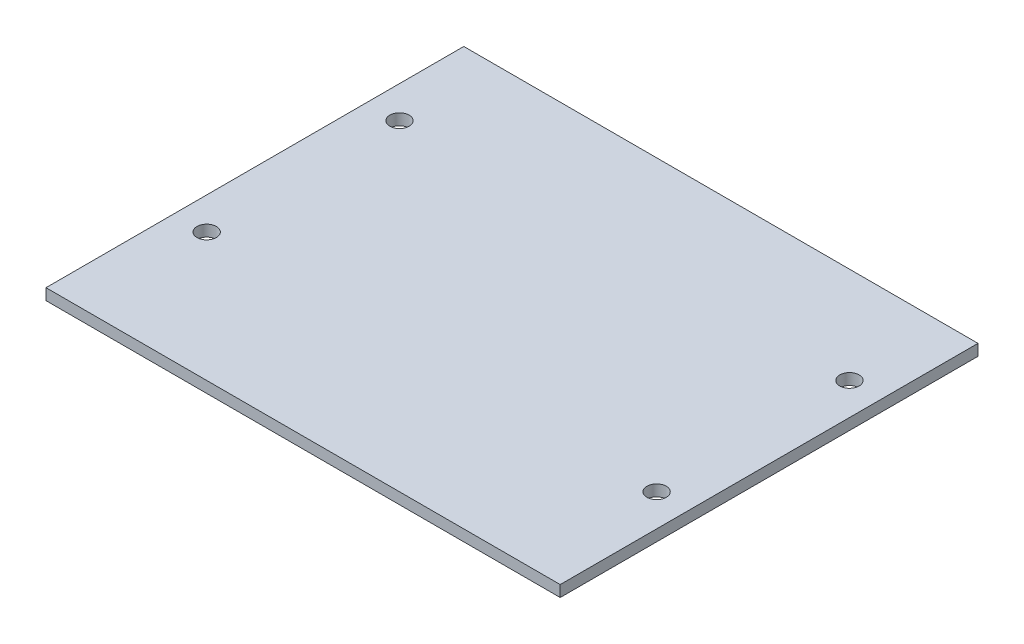
ISO-10303-21;
HEADER;
FILE_DESCRIPTION(('STEP AP214'),'2;1');
FILE_NAME('part.step','',(''),(''),'','','');
FILE_SCHEMA(('AUTOMOTIVE_DESIGN { 1 0 10303 214 1 1 1 1 }'));
ENDSEC;
DATA;
#1=APPLICATION_CONTEXT('core data for automotive mechanical design processes');
#2=APPLICATION_PROTOCOL_DEFINITION('international standard','automotive_design',2000,#1);
#3=PRODUCT_CONTEXT('',#1,'mechanical');
#4=PRODUCT('Part','Part','',(#3));
#5=PRODUCT_RELATED_PRODUCT_CATEGORY('part','',(#4));
#6=PRODUCT_DEFINITION_FORMATION('','',#4);
#7=PRODUCT_DEFINITION_CONTEXT('part definition',#1,'design');
#8=PRODUCT_DEFINITION('design','',#6,#7);
#9=PRODUCT_DEFINITION_SHAPE('','',#8);
#10=(LENGTH_UNIT() NAMED_UNIT(*) SI_UNIT(.MILLI.,.METRE.));
#11=(NAMED_UNIT(*) PLANE_ANGLE_UNIT() SI_UNIT($,.RADIAN.));
#12=(NAMED_UNIT(*) SI_UNIT($,.STERADIAN.) SOLID_ANGLE_UNIT());
#13=UNCERTAINTY_MEASURE_WITH_UNIT(LENGTH_MEASURE(1.E-05),#10,'distance_accuracy_value','');
#14=(GEOMETRIC_REPRESENTATION_CONTEXT(3) GLOBAL_UNCERTAINTY_ASSIGNED_CONTEXT((#13)) GLOBAL_UNIT_ASSIGNED_CONTEXT((#10,
#11,#12)) REPRESENTATION_CONTEXT('',''));
#15=CARTESIAN_POINT('',(0.,0.,0.));
#16=DIRECTION('',(0.,0.,1.));
#17=DIRECTION('',(1.,0.,0.));
#18=AXIS2_PLACEMENT_3D('',#15,#16,#17);
#19=CARTESIAN_POINT('',(0.,1.75,0.));
#20=DIRECTION('',(0.,1.,0.));
#21=DIRECTION('',(0.,0.,1.));
#22=AXIS2_PLACEMENT_3D('',#19,#20,#21);
#23=PLANE('',#22);
#24=CARTESIAN_POINT('',(35.,1.75,-17.5));
#25=DIRECTION('',(0.,1.,0.));
#26=DIRECTION('',(0.,0.,1.));
#27=AXIS2_PLACEMENT_3D('',#24,#25,#26);
#28=CIRCLE('',#27,1.5025);
#29=CARTESIAN_POINT('',(35.,1.75,-15.9975));
#30=VERTEX_POINT('',#29);
#31=EDGE_CURVE('E120',#30,#30,#28,.T.);
#32=ORIENTED_EDGE('',*,*,#31,.F.);
#33=EDGE_LOOP('',(#32));
#34=FACE_BOUND('',#33,.T.);
#35=CARTESIAN_POINT('',(-35.,1.75,12.5));
#36=DIRECTION('',(0.,1.,0.));
#37=DIRECTION('',(0.,0.,1.));
#38=AXIS2_PLACEMENT_3D('',#35,#36,#37);
#39=CIRCLE('',#38,1.5025);
#40=CARTESIAN_POINT('',(-35.,1.75,14.0025));
#41=VERTEX_POINT('',#40);
#42=EDGE_CURVE('E99',#41,#41,#39,.T.);
#43=ORIENTED_EDGE('',*,*,#42,.F.);
#44=EDGE_LOOP('',(#43));
#45=FACE_BOUND('',#44,.T.);
#46=DIRECTION('',(0.,0.,1.));
#47=VECTOR('',#46,1.);
#48=CARTESIAN_POINT('',(-40.,1.75,-32.5));
#49=LINE('',#48,#47);
#50=CARTESIAN_POINT('',(-40.,1.75,-32.5));
#51=VERTEX_POINT('',#50);
#52=CARTESIAN_POINT('',(-40.,1.75,32.5));
#53=VERTEX_POINT('',#52);
#54=EDGE_CURVE('E84',#51,#53,#49,.T.);
#55=ORIENTED_EDGE('',*,*,#54,.T.);
#56=DIRECTION('',(1.,0.,0.));
#57=VECTOR('',#56,1.);
#58=CARTESIAN_POINT('',(-40.,1.75,32.5));
#59=LINE('',#58,#57);
#60=CARTESIAN_POINT('',(40.,1.75,32.5));
#61=VERTEX_POINT('',#60);
#62=EDGE_CURVE('E79',#53,#61,#59,.T.);
#63=ORIENTED_EDGE('',*,*,#62,.T.);
#64=DIRECTION('',(0.,0.,-1.));
#65=VECTOR('',#64,1.);
#66=CARTESIAN_POINT('',(40.,1.75,-32.5));
#67=LINE('',#66,#65);
#68=CARTESIAN_POINT('',(40.,1.75,-32.5));
#69=VERTEX_POINT('',#68);
#70=EDGE_CURVE('E82',#61,#69,#67,.T.);
#71=ORIENTED_EDGE('',*,*,#70,.T.);
#72=DIRECTION('',(-1.,0.,0.));
#73=VECTOR('',#72,1.);
#74=CARTESIAN_POINT('',(-40.,1.75,-32.5));
#75=LINE('',#74,#73);
#76=EDGE_CURVE('E49',#69,#51,#75,.T.);
#77=ORIENTED_EDGE('',*,*,#76,.T.);
#78=EDGE_LOOP('',(#55,#63,#71,#77));
#79=FACE_BOUND('',#78,.T.);
#80=CARTESIAN_POINT('',(35.,1.75,12.5));
#81=DIRECTION('',(0.,1.,0.));
#82=DIRECTION('',(0.,0.,1.));
#83=AXIS2_PLACEMENT_3D('',#80,#81,#82);
#84=CIRCLE('',#83,1.5025);
#85=CARTESIAN_POINT('',(35.,1.75,14.0025));
#86=VERTEX_POINT('',#85);
#87=EDGE_CURVE('E114',#86,#86,#84,.T.);
#88=ORIENTED_EDGE('',*,*,#87,.F.);
#89=EDGE_LOOP('',(#88));
#90=FACE_BOUND('',#89,.T.);
#91=CARTESIAN_POINT('',(-35.,1.75,-17.5));
#92=DIRECTION('',(0.,1.,0.));
#93=DIRECTION('',(0.,0.,1.));
#94=AXIS2_PLACEMENT_3D('',#91,#92,#93);
#95=CIRCLE('',#94,1.5025);
#96=CARTESIAN_POINT('',(-35.,1.75,-15.9975));
#97=VERTEX_POINT('',#96);
#98=EDGE_CURVE('E126',#97,#97,#95,.T.);
#99=ORIENTED_EDGE('',*,*,#98,.F.);
#100=EDGE_LOOP('',(#99));
#101=FACE_BOUND('',#100,.T.);
#102=ADVANCED_FACE('F32',(#34,#45,#79,#90,#101),#23,.T.);
#103=CARTESIAN_POINT('',(0.,0.,0.));
#104=DIRECTION('',(0.,1.,0.));
#105=DIRECTION('',(0.,0.,1.));
#106=AXIS2_PLACEMENT_3D('',#103,#104,#105);
#107=PLANE('',#106);
#108=DIRECTION('',(0.,0.,1.));
#109=VECTOR('',#108,1.);
#110=CARTESIAN_POINT('',(-40.,0.,-32.5));
#111=LINE('',#110,#109);
#112=CARTESIAN_POINT('',(-40.,0.,-32.5));
#113=VERTEX_POINT('',#112);
#114=CARTESIAN_POINT('',(-40.,0.,32.5));
#115=VERTEX_POINT('',#114);
#116=EDGE_CURVE('E96',#113,#115,#111,.T.);
#117=ORIENTED_EDGE('',*,*,#116,.F.);
#118=DIRECTION('',(-1.,0.,0.));
#119=VECTOR('',#118,1.);
#120=CARTESIAN_POINT('',(-40.,0.,-32.5));
#121=LINE('',#120,#119);
#122=CARTESIAN_POINT('',(40.,0.,-32.5));
#123=VERTEX_POINT('',#122);
#124=EDGE_CURVE('E72',#123,#113,#121,.T.);
#125=ORIENTED_EDGE('',*,*,#124,.F.);
#126=DIRECTION('',(0.,0.,-1.));
#127=VECTOR('',#126,1.);
#128=CARTESIAN_POINT('',(40.,0.,-32.5));
#129=LINE('',#128,#127);
#130=CARTESIAN_POINT('',(40.,0.,32.5));
#131=VERTEX_POINT('',#130);
#132=EDGE_CURVE('E66',#131,#123,#129,.T.);
#133=ORIENTED_EDGE('',*,*,#132,.F.);
#134=DIRECTION('',(1.,0.,0.));
#135=VECTOR('',#134,1.);
#136=CARTESIAN_POINT('',(-40.,0.,32.5));
#137=LINE('',#136,#135);
#138=EDGE_CURVE('E88',#115,#131,#137,.T.);
#139=ORIENTED_EDGE('',*,*,#138,.F.);
#140=EDGE_LOOP('',(#117,#125,#133,#139));
#141=FACE_BOUND('',#140,.T.);
#142=CARTESIAN_POINT('',(-35.,0.,12.5));
#143=DIRECTION('',(0.,1.,0.));
#144=DIRECTION('',(0.,0.,1.));
#145=AXIS2_PLACEMENT_3D('',#142,#143,#144);
#146=CIRCLE('',#145,1.5025);
#147=CARTESIAN_POINT('',(-35.,0.,14.0025));
#148=VERTEX_POINT('',#147);
#149=EDGE_CURVE('E111',#148,#148,#146,.T.);
#150=ORIENTED_EDGE('',*,*,#149,.T.);
#151=EDGE_LOOP('',(#150));
#152=FACE_BOUND('',#151,.T.);
#153=CARTESIAN_POINT('',(35.,0.,12.5));
#154=DIRECTION('',(0.,1.,0.));
#155=DIRECTION('',(0.,0.,1.));
#156=AXIS2_PLACEMENT_3D('',#153,#154,#155);
#157=CIRCLE('',#156,1.5025);
#158=CARTESIAN_POINT('',(35.,0.,14.0025));
#159=VERTEX_POINT('',#158);
#160=EDGE_CURVE('E117',#159,#159,#157,.T.);
#161=ORIENTED_EDGE('',*,*,#160,.T.);
#162=EDGE_LOOP('',(#161));
#163=FACE_BOUND('',#162,.T.);
#164=CARTESIAN_POINT('',(35.,0.,-17.5));
#165=DIRECTION('',(0.,1.,0.));
#166=DIRECTION('',(0.,0.,1.));
#167=AXIS2_PLACEMENT_3D('',#164,#165,#166);
#168=CIRCLE('',#167,1.5025);
#169=CARTESIAN_POINT('',(35.,0.,-15.9975));
#170=VERTEX_POINT('',#169);
#171=EDGE_CURVE('E123',#170,#170,#168,.T.);
#172=ORIENTED_EDGE('',*,*,#171,.T.);
#173=EDGE_LOOP('',(#172));
#174=FACE_BOUND('',#173,.T.);
#175=CARTESIAN_POINT('',(-35.,0.,-17.5));
#176=DIRECTION('',(0.,1.,0.));
#177=DIRECTION('',(0.,0.,1.));
#178=AXIS2_PLACEMENT_3D('',#175,#176,#177);
#179=CIRCLE('',#178,1.5025);
#180=CARTESIAN_POINT('',(-35.,0.,-15.9975));
#181=VERTEX_POINT('',#180);
#182=EDGE_CURVE('E129',#181,#181,#179,.T.);
#183=ORIENTED_EDGE('',*,*,#182,.T.);
#184=EDGE_LOOP('',(#183));
#185=FACE_BOUND('',#184,.T.);
#186=ADVANCED_FACE('F107',(#141,#152,#163,#174,#185),#107,.F.);
#187=CARTESIAN_POINT('',(-40.,1.75,-32.5));
#188=DIRECTION('',(1.,0.,0.));
#189=DIRECTION('',(0.,0.,-1.));
#190=AXIS2_PLACEMENT_3D('',#187,#188,#189);
#191=PLANE('',#190);
#192=ORIENTED_EDGE('',*,*,#116,.T.);
#193=DIRECTION('',(0.,-1.,0.));
#194=VECTOR('',#193,1.);
#195=CARTESIAN_POINT('',(-40.,1.75,32.5));
#196=LINE('',#195,#194);
#197=EDGE_CURVE('E11',#53,#115,#196,.T.);
#198=ORIENTED_EDGE('',*,*,#197,.F.);
#199=ORIENTED_EDGE('',*,*,#54,.F.);
#200=DIRECTION('',(0.,-1.,0.));
#201=VECTOR('',#200,1.);
#202=CARTESIAN_POINT('',(-40.,1.75,-32.5));
#203=LINE('',#202,#201);
#204=EDGE_CURVE('E92',#51,#113,#203,.T.);
#205=ORIENTED_EDGE('',*,*,#204,.T.);
#206=EDGE_LOOP('',(#192,#198,#199,#205));
#207=FACE_BOUND('',#206,.T.);
#208=ADVANCED_FACE('F34',(#207),#191,.F.);
#209=CARTESIAN_POINT('',(-40.,1.75,32.5));
#210=DIRECTION('',(0.,0.,-1.));
#211=DIRECTION('',(-1.,0.,0.));
#212=AXIS2_PLACEMENT_3D('',#209,#210,#211);
#213=PLANE('',#212);
#214=ORIENTED_EDGE('',*,*,#138,.T.);
#215=DIRECTION('',(0.,-1.,0.));
#216=VECTOR('',#215,1.);
#217=CARTESIAN_POINT('',(40.,1.75,32.5));
#218=LINE('',#217,#216);
#219=EDGE_CURVE('E41',#61,#131,#218,.T.);
#220=ORIENTED_EDGE('',*,*,#219,.F.);
#221=ORIENTED_EDGE('',*,*,#62,.F.);
#222=ORIENTED_EDGE('',*,*,#197,.T.);
#223=EDGE_LOOP('',(#214,#220,#221,#222));
#224=FACE_BOUND('',#223,.T.);
#225=ADVANCED_FACE('F87',(#224),#213,.F.);
#226=CARTESIAN_POINT('',(40.,1.75,-32.5));
#227=DIRECTION('',(-1.,0.,0.));
#228=DIRECTION('',(0.,0.,1.));
#229=AXIS2_PLACEMENT_3D('',#226,#227,#228);
#230=PLANE('',#229);
#231=ORIENTED_EDGE('',*,*,#132,.T.);
#232=DIRECTION('',(0.,-1.,0.));
#233=VECTOR('',#232,1.);
#234=CARTESIAN_POINT('',(40.,1.75,-32.5));
#235=LINE('',#234,#233);
#236=EDGE_CURVE('E89',#69,#123,#235,.T.);
#237=ORIENTED_EDGE('',*,*,#236,.F.);
#238=ORIENTED_EDGE('',*,*,#70,.F.);
#239=ORIENTED_EDGE('',*,*,#219,.T.);
#240=EDGE_LOOP('',(#231,#237,#238,#239));
#241=FACE_BOUND('',#240,.T.);
#242=ADVANCED_FACE('F90',(#241),#230,.F.);
#243=CARTESIAN_POINT('',(-40.,1.75,-32.5));
#244=DIRECTION('',(0.,0.,1.));
#245=DIRECTION('',(1.,0.,0.));
#246=AXIS2_PLACEMENT_3D('',#243,#244,#245);
#247=PLANE('',#246);
#248=ORIENTED_EDGE('',*,*,#124,.T.);
#249=ORIENTED_EDGE('',*,*,#204,.F.);
#250=ORIENTED_EDGE('',*,*,#76,.F.);
#251=ORIENTED_EDGE('',*,*,#236,.T.);
#252=EDGE_LOOP('',(#248,#249,#250,#251));
#253=FACE_BOUND('',#252,.T.);
#254=ADVANCED_FACE('F104',(#253),#247,.F.);
#255=CARTESIAN_POINT('',(-35.,1.75,12.5));
#256=DIRECTION('',(0.,-1.,0.));
#257=DIRECTION('',(0.,0.,-1.));
#258=AXIS2_PLACEMENT_3D('',#255,#256,#257);
#259=CYLINDRICAL_SURFACE('',#258,1.5025);
#260=ORIENTED_EDGE('',*,*,#42,.T.);
#261=EDGE_LOOP('',(#260));
#262=FACE_BOUND('',#261,.T.);
#263=ORIENTED_EDGE('',*,*,#149,.F.);
#264=EDGE_LOOP('',(#263));
#265=FACE_BOUND('',#264,.T.);
#266=ADVANCED_FACE('F148',(#262,#265),#259,.F.);
#267=CARTESIAN_POINT('',(35.,1.75,12.5));
#268=DIRECTION('',(0.,-1.,0.));
#269=DIRECTION('',(0.,0.,-1.));
#270=AXIS2_PLACEMENT_3D('',#267,#268,#269);
#271=CYLINDRICAL_SURFACE('',#270,1.5025);
#272=ORIENTED_EDGE('',*,*,#87,.T.);
#273=EDGE_LOOP('',(#272));
#274=FACE_BOUND('',#273,.T.);
#275=ORIENTED_EDGE('',*,*,#160,.F.);
#276=EDGE_LOOP('',(#275));
#277=FACE_BOUND('',#276,.T.);
#278=ADVANCED_FACE('F194',(#274,#277),#271,.F.);
#279=CARTESIAN_POINT('',(35.,1.75,-17.5));
#280=DIRECTION('',(0.,-1.,0.));
#281=DIRECTION('',(0.,0.,-1.));
#282=AXIS2_PLACEMENT_3D('',#279,#280,#281);
#283=CYLINDRICAL_SURFACE('',#282,1.5025);
#284=ORIENTED_EDGE('',*,*,#31,.T.);
#285=EDGE_LOOP('',(#284));
#286=FACE_BOUND('',#285,.T.);
#287=ORIENTED_EDGE('',*,*,#171,.F.);
#288=EDGE_LOOP('',(#287));
#289=FACE_BOUND('',#288,.T.);
#290=ADVANCED_FACE('F202',(#286,#289),#283,.F.);
#291=CARTESIAN_POINT('',(-35.,1.75,-17.5));
#292=DIRECTION('',(0.,-1.,0.));
#293=DIRECTION('',(0.,0.,-1.));
#294=AXIS2_PLACEMENT_3D('',#291,#292,#293);
#295=CYLINDRICAL_SURFACE('',#294,1.5025);
#296=ORIENTED_EDGE('',*,*,#98,.T.);
#297=EDGE_LOOP('',(#296));
#298=FACE_BOUND('',#297,.T.);
#299=ORIENTED_EDGE('',*,*,#182,.F.);
#300=EDGE_LOOP('',(#299));
#301=FACE_BOUND('',#300,.T.);
#302=ADVANCED_FACE('F135',(#298,#301),#295,.F.);
#303=CLOSED_SHELL('',(#102,#186,#208,#225,#242,#254,#266,#278,#290,#302));
#304=MANIFOLD_SOLID_BREP('B2',#303);
#305=ADVANCED_BREP_SHAPE_REPRESENTATION('',(#18,#304),#14);
#306=SHAPE_DEFINITION_REPRESENTATION(#9,#305);
ENDSEC;
END-ISO-10303-21;
